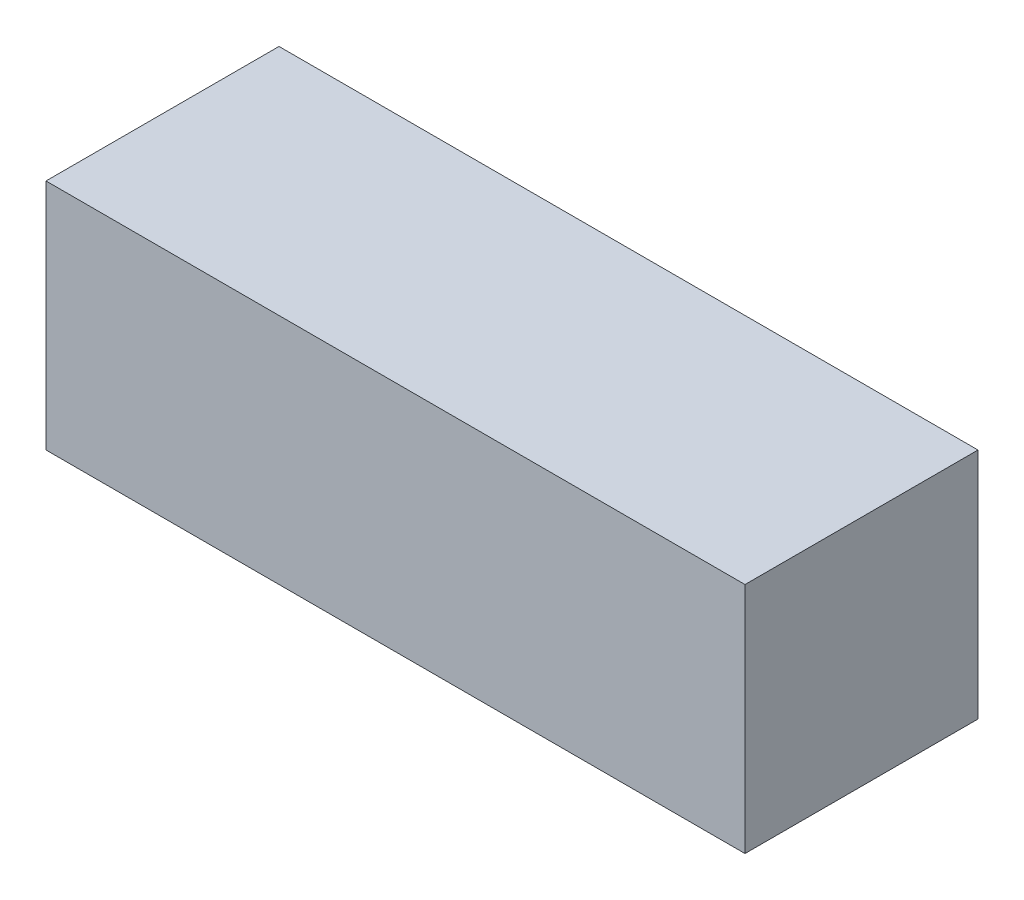
ISO-10303-21;
HEADER;
FILE_DESCRIPTION(('STEP AP214'),'2;1');
FILE_NAME('part.step','',(''),(''),'','','');
FILE_SCHEMA(('AUTOMOTIVE_DESIGN { 1 0 10303 214 1 1 1 1 }'));
ENDSEC;
DATA;
#1=APPLICATION_CONTEXT('core data for automotive mechanical design processes');
#2=APPLICATION_PROTOCOL_DEFINITION('international standard','automotive_design',2000,#1);
#3=PRODUCT_CONTEXT('',#1,'mechanical');
#4=PRODUCT('Part','Part','',(#3));
#5=PRODUCT_RELATED_PRODUCT_CATEGORY('part','',(#4));
#6=PRODUCT_DEFINITION_FORMATION('','',#4);
#7=PRODUCT_DEFINITION_CONTEXT('part definition',#1,'design');
#8=PRODUCT_DEFINITION('design','',#6,#7);
#9=PRODUCT_DEFINITION_SHAPE('','',#8);
#10=(LENGTH_UNIT() NAMED_UNIT(*) SI_UNIT(.MILLI.,.METRE.));
#11=(NAMED_UNIT(*) PLANE_ANGLE_UNIT() SI_UNIT($,.RADIAN.));
#12=(NAMED_UNIT(*) SI_UNIT($,.STERADIAN.) SOLID_ANGLE_UNIT());
#13=UNCERTAINTY_MEASURE_WITH_UNIT(LENGTH_MEASURE(1.E-05),#10,'distance_accuracy_value','');
#14=(GEOMETRIC_REPRESENTATION_CONTEXT(3) GLOBAL_UNCERTAINTY_ASSIGNED_CONTEXT((#13)) GLOBAL_UNIT_ASSIGNED_CONTEXT((#10,
#11,#12)) REPRESENTATION_CONTEXT('',''));
#15=CARTESIAN_POINT('',(0.,0.,0.));
#16=DIRECTION('',(0.,0.,1.));
#17=DIRECTION('',(1.,0.,0.));
#18=AXIS2_PLACEMENT_3D('',#15,#16,#17);
#19=CARTESIAN_POINT('',(30.,0.,0.));
#20=DIRECTION('',(0.,0.,-1.));
#21=DIRECTION('',(-1.,0.,0.));
#22=AXIS2_PLACEMENT_3D('',#19,#20,#21);
#23=PLANE('',#22);
#24=DIRECTION('',(0.,-1.,0.));
#25=VECTOR('',#24,1.);
#26=CARTESIAN_POINT('',(0.,0.,0.));
#27=LINE('',#26,#25);
#28=CARTESIAN_POINT('',(0.,10.,0.));
#29=VERTEX_POINT('',#28);
#30=CARTESIAN_POINT('',(0.,0.,0.));
#31=VERTEX_POINT('',#30);
#32=EDGE_CURVE('E107',#29,#31,#27,.T.);
#33=ORIENTED_EDGE('',*,*,#32,.T.);
#34=DIRECTION('',(-1.,0.,0.));
#35=VECTOR('',#34,1.);
#36=CARTESIAN_POINT('',(30.,0.,0.));
#37=LINE('',#36,#35);
#38=CARTESIAN_POINT('',(30.,0.,0.));
#39=VERTEX_POINT('',#38);
#40=EDGE_CURVE('E11',#39,#31,#37,.T.);
#41=ORIENTED_EDGE('',*,*,#40,.F.);
#42=DIRECTION('',(0.,-1.,0.));
#43=VECTOR('',#42,1.);
#44=CARTESIAN_POINT('',(30.,0.,0.));
#45=LINE('',#44,#43);
#46=CARTESIAN_POINT('',(30.,10.,0.));
#47=VERTEX_POINT('',#46);
#48=EDGE_CURVE('E91',#47,#39,#45,.T.);
#49=ORIENTED_EDGE('',*,*,#48,.F.);
#50=DIRECTION('',(-1.,0.,0.));
#51=VECTOR('',#50,1.);
#52=CARTESIAN_POINT('',(30.,10.,0.));
#53=LINE('',#52,#51);
#54=EDGE_CURVE('E103',#47,#29,#53,.T.);
#55=ORIENTED_EDGE('',*,*,#54,.T.);
#56=EDGE_LOOP('',(#33,#41,#49,#55));
#57=FACE_BOUND('',#56,.T.);
#58=ADVANCED_FACE('F39',(#57),#23,.F.);
#59=CARTESIAN_POINT('',(30.,0.,0.));
#60=DIRECTION('',(0.,1.,0.));
#61=DIRECTION('',(0.,0.,1.));
#62=AXIS2_PLACEMENT_3D('',#59,#60,#61);
#63=PLANE('',#62);
#64=DIRECTION('',(0.,0.,-1.));
#65=VECTOR('',#64,1.);
#66=CARTESIAN_POINT('',(0.,0.,0.));
#67=LINE('',#66,#65);
#68=CARTESIAN_POINT('',(0.,0.,-10.));
#69=VERTEX_POINT('',#68);
#70=EDGE_CURVE('E96',#31,#69,#67,.T.);
#71=ORIENTED_EDGE('',*,*,#70,.T.);
#72=DIRECTION('',(-1.,0.,0.));
#73=VECTOR('',#72,1.);
#74=CARTESIAN_POINT('',(30.,0.,-10.));
#75=LINE('',#74,#73);
#76=CARTESIAN_POINT('',(30.,0.,-10.));
#77=VERTEX_POINT('',#76);
#78=EDGE_CURVE('E48',#77,#69,#75,.T.);
#79=ORIENTED_EDGE('',*,*,#78,.F.);
#80=DIRECTION('',(0.,0.,-1.));
#81=VECTOR('',#80,1.);
#82=CARTESIAN_POINT('',(30.,0.,0.));
#83=LINE('',#82,#81);
#84=EDGE_CURVE('E86',#39,#77,#83,.T.);
#85=ORIENTED_EDGE('',*,*,#84,.F.);
#86=ORIENTED_EDGE('',*,*,#40,.T.);
#87=EDGE_LOOP('',(#71,#79,#85,#86));
#88=FACE_BOUND('',#87,.T.);
#89=ADVANCED_FACE('F95',(#88),#63,.F.);
#90=CARTESIAN_POINT('',(30.,0.,-10.));
#91=DIRECTION('',(0.,0.,1.));
#92=DIRECTION('',(1.,0.,0.));
#93=AXIS2_PLACEMENT_3D('',#90,#91,#92);
#94=PLANE('',#93);
#95=DIRECTION('',(0.,1.,0.));
#96=VECTOR('',#95,1.);
#97=CARTESIAN_POINT('',(0.,0.,-10.));
#98=LINE('',#97,#96);
#99=CARTESIAN_POINT('',(0.,10.,-10.));
#100=VERTEX_POINT('',#99);
#101=EDGE_CURVE('E73',#69,#100,#98,.T.);
#102=ORIENTED_EDGE('',*,*,#101,.T.);
#103=DIRECTION('',(-1.,0.,0.));
#104=VECTOR('',#103,1.);
#105=CARTESIAN_POINT('',(30.,10.,-10.));
#106=LINE('',#105,#104);
#107=CARTESIAN_POINT('',(30.,10.,-10.));
#108=VERTEX_POINT('',#107);
#109=EDGE_CURVE('E98',#108,#100,#106,.T.);
#110=ORIENTED_EDGE('',*,*,#109,.F.);
#111=DIRECTION('',(0.,1.,0.));
#112=VECTOR('',#111,1.);
#113=CARTESIAN_POINT('',(30.,0.,-10.));
#114=LINE('',#113,#112);
#115=EDGE_CURVE('E89',#77,#108,#114,.T.);
#116=ORIENTED_EDGE('',*,*,#115,.F.);
#117=ORIENTED_EDGE('',*,*,#78,.T.);
#118=EDGE_LOOP('',(#102,#110,#116,#117));
#119=FACE_BOUND('',#118,.T.);
#120=ADVANCED_FACE('F99',(#119),#94,.F.);
#121=CARTESIAN_POINT('',(30.,10.,0.));
#122=DIRECTION('',(0.,-1.,0.));
#123=DIRECTION('',(0.,0.,-1.));
#124=AXIS2_PLACEMENT_3D('',#121,#122,#123);
#125=PLANE('',#124);
#126=DIRECTION('',(0.,0.,1.));
#127=VECTOR('',#126,1.);
#128=CARTESIAN_POINT('',(0.,10.,0.));
#129=LINE('',#128,#127);
#130=EDGE_CURVE('E79',#100,#29,#129,.T.);
#131=ORIENTED_EDGE('',*,*,#130,.T.);
#132=ORIENTED_EDGE('',*,*,#54,.F.);
#133=DIRECTION('',(0.,0.,1.));
#134=VECTOR('',#133,1.);
#135=CARTESIAN_POINT('',(30.,10.,0.));
#136=LINE('',#135,#134);
#137=EDGE_CURVE('E56',#108,#47,#136,.T.);
#138=ORIENTED_EDGE('',*,*,#137,.F.);
#139=ORIENTED_EDGE('',*,*,#109,.T.);
#140=EDGE_LOOP('',(#131,#132,#138,#139));
#141=FACE_BOUND('',#140,.T.);
#142=ADVANCED_FACE('F120',(#141),#125,.F.);
#143=CARTESIAN_POINT('',(30.,0.,0.));
#144=DIRECTION('',(-1.,0.,0.));
#145=DIRECTION('',(0.,0.,1.));
#146=AXIS2_PLACEMENT_3D('',#143,#144,#145);
#147=PLANE('',#146);
#148=ORIENTED_EDGE('',*,*,#48,.T.);
#149=ORIENTED_EDGE('',*,*,#84,.T.);
#150=ORIENTED_EDGE('',*,*,#115,.T.);
#151=ORIENTED_EDGE('',*,*,#137,.T.);
#152=EDGE_LOOP('',(#148,#149,#150,#151));
#153=FACE_BOUND('',#152,.T.);
#154=ADVANCED_FACE('F87',(#153),#147,.F.);
#155=CARTESIAN_POINT('',(0.,0.,0.));
#156=DIRECTION('',(-1.,0.,0.));
#157=DIRECTION('',(0.,0.,1.));
#158=AXIS2_PLACEMENT_3D('',#155,#156,#157);
#159=PLANE('',#158);
#160=ORIENTED_EDGE('',*,*,#32,.F.);
#161=ORIENTED_EDGE('',*,*,#130,.F.);
#162=ORIENTED_EDGE('',*,*,#101,.F.);
#163=ORIENTED_EDGE('',*,*,#70,.F.);
#164=EDGE_LOOP('',(#160,#161,#162,#163));
#165=FACE_BOUND('',#164,.T.);
#166=ADVANCED_FACE('F123',(#165),#159,.T.);
#167=CLOSED_SHELL('',(#58,#89,#120,#142,#154,#166));
#168=MANIFOLD_SOLID_BREP('B2',#167);
#169=ADVANCED_BREP_SHAPE_REPRESENTATION('',(#18,#168),#14);
#170=SHAPE_DEFINITION_REPRESENTATION(#9,#169);
ENDSEC;
END-ISO-10303-21;
